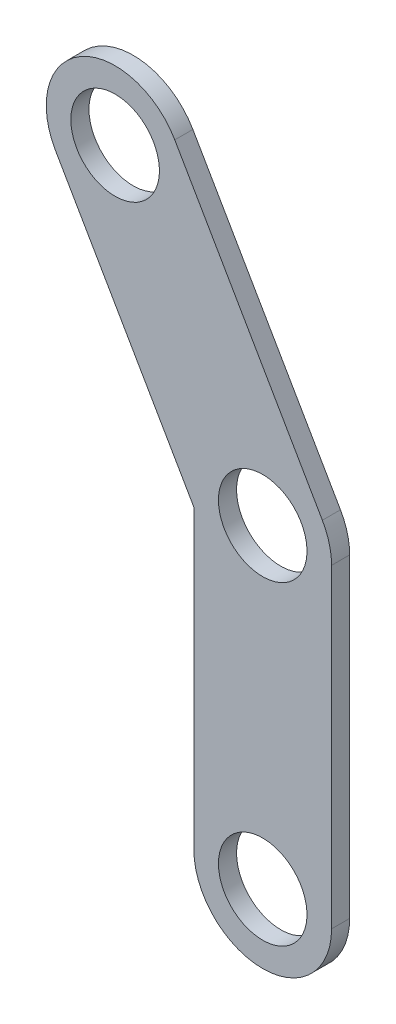
ISO-10303-21;
HEADER;
FILE_DESCRIPTION(('STEP AP214'),'2;1');
FILE_NAME('part.step','',(''),(''),'','','');
FILE_SCHEMA(('AUTOMOTIVE_DESIGN { 1 0 10303 214 1 1 1 1 }'));
ENDSEC;
DATA;
#1=APPLICATION_CONTEXT('core data for automotive mechanical design processes');
#2=APPLICATION_PROTOCOL_DEFINITION('international standard','automotive_design',2000,#1);
#3=PRODUCT_CONTEXT('',#1,'mechanical');
#4=PRODUCT('Part','Part','',(#3));
#5=PRODUCT_RELATED_PRODUCT_CATEGORY('part','',(#4));
#6=PRODUCT_DEFINITION_FORMATION('','',#4);
#7=PRODUCT_DEFINITION_CONTEXT('part definition',#1,'design');
#8=PRODUCT_DEFINITION('design','',#6,#7);
#9=PRODUCT_DEFINITION_SHAPE('','',#8);
#10=(LENGTH_UNIT() NAMED_UNIT(*) SI_UNIT(.MILLI.,.METRE.));
#11=(NAMED_UNIT(*) PLANE_ANGLE_UNIT() SI_UNIT($,.RADIAN.));
#12=(NAMED_UNIT(*) SI_UNIT($,.STERADIAN.) SOLID_ANGLE_UNIT());
#13=UNCERTAINTY_MEASURE_WITH_UNIT(LENGTH_MEASURE(1.E-05),#10,'distance_accuracy_value','');
#14=(GEOMETRIC_REPRESENTATION_CONTEXT(3) GLOBAL_UNCERTAINTY_ASSIGNED_CONTEXT((#13)) GLOBAL_UNIT_ASSIGNED_CONTEXT((#10,
#11,#12)) REPRESENTATION_CONTEXT('',''));
#15=CARTESIAN_POINT('',(0.,0.,0.));
#16=DIRECTION('',(0.,0.,1.));
#17=DIRECTION('',(1.,0.,0.));
#18=AXIS2_PLACEMENT_3D('',#15,#16,#17);
#19=CARTESIAN_POINT('',(25.4623037863386,14.7006679451928,5.842));
#20=DIRECTION('',(0.866025403784995,0.499999999999036,0.));
#21=DIRECTION('',(-0.499999999999036,0.866025403784995,0.));
#22=AXIS2_PLACEMENT_3D('',#19,#20,#21);
#23=PLANE('',#22);
#24=DIRECTION('',(0.499999999999036,-0.866025403784995,0.));
#25=VECTOR('',#24,1.);
#26=CARTESIAN_POINT('',(25.4623037863386,14.7006679451928,0.));
#27=LINE('',#26,#25);
#28=CARTESIAN_POINT('',(-79.9411607588512,197.264823831716,0.));
#29=VERTEX_POINT('',#28);
#30=CARTESIAN_POINT('',(-32.316160758943,114.775904121195,0.));
#31=VERTEX_POINT('',#30);
#32=EDGE_CURVE('E138',#29,#31,#27,.T.);
#33=ORIENTED_EDGE('',*,*,#32,.F.);
#34=DIRECTION('',(0.,0.,-1.));
#35=VECTOR('',#34,1.);
#36=CARTESIAN_POINT('',(-79.9411607588512,197.264823831716,5.842));
#37=LINE('',#36,#35);
#38=CARTESIAN_POINT('',(-79.9411607588512,197.264823831716,5.842));
#39=VERTEX_POINT('',#38);
#40=EDGE_CURVE('E11',#39,#29,#37,.T.);
#41=ORIENTED_EDGE('',*,*,#40,.F.);
#42=DIRECTION('',(0.499999999999036,-0.866025403784995,0.));
#43=VECTOR('',#42,1.);
#44=CARTESIAN_POINT('',(25.4623037863386,14.7006679451928,5.842));
#45=LINE('',#44,#43);
#46=CARTESIAN_POINT('',(-32.316160758943,114.775904121195,5.842));
#47=VERTEX_POINT('',#46);
#48=EDGE_CURVE('E164',#39,#47,#45,.T.);
#49=ORIENTED_EDGE('',*,*,#48,.T.);
#50=DIRECTION('',(0.,0.,-1.));
#51=VECTOR('',#50,1.);
#52=CARTESIAN_POINT('',(-32.316160758943,114.775904121195,5.842));
#53=LINE('',#52,#51);
#54=EDGE_CURVE('E40',#47,#31,#53,.T.);
#55=ORIENTED_EDGE('',*,*,#54,.T.);
#56=EDGE_LOOP('',(#33,#41,#49,#55));
#57=FACE_BOUND('',#56,.T.);
#58=ADVANCED_FACE('F37',(#57),#23,.T.);
#59=CARTESIAN_POINT('',(-99.1885753579727,186.152323831737,5.842));
#60=DIRECTION('',(0.,0.,-1.));
#61=DIRECTION('',(-1.,0.,0.));
#62=AXIS2_PLACEMENT_3D('',#59,#60,#61);
#63=CYLINDRICAL_SURFACE('',#62,22.225);
#64=CARTESIAN_POINT('',(-99.1885753579727,186.152323831737,0.));
#65=DIRECTION('',(0.,0.,-1.));
#66=DIRECTION('',(-1.,0.,0.));
#67=AXIS2_PLACEMENT_3D('',#64,#65,#66);
#68=CIRCLE('',#67,22.225);
#69=CARTESIAN_POINT('',(-118.435989957081,175.039823831736,0.));
#70=VERTEX_POINT('',#69);
#71=EDGE_CURVE('E153',#70,#29,#68,.T.);
#72=ORIENTED_EDGE('',*,*,#71,.F.);
#73=DIRECTION('',(0.,0.,-1.));
#74=VECTOR('',#73,1.);
#75=CARTESIAN_POINT('',(-118.435989957081,175.039823831736,5.842));
#76=LINE('',#75,#74);
#77=CARTESIAN_POINT('',(-118.435989957081,175.039823831736,5.842));
#78=VERTEX_POINT('',#77);
#79=EDGE_CURVE('E46',#78,#70,#76,.T.);
#80=ORIENTED_EDGE('',*,*,#79,.F.);
#81=CARTESIAN_POINT('',(-99.1885753579727,186.152323831737,5.842));
#82=DIRECTION('',(0.,0.,-1.));
#83=DIRECTION('',(-1.,0.,0.));
#84=AXIS2_PLACEMENT_3D('',#81,#82,#83);
#85=CIRCLE('',#84,22.225);
#86=EDGE_CURVE('E111',#78,#39,#85,.T.);
#87=ORIENTED_EDGE('',*,*,#86,.T.);
#88=ORIENTED_EDGE('',*,*,#40,.T.);
#89=EDGE_LOOP('',(#72,#80,#87,#88));
#90=FACE_BOUND('',#89,.T.);
#91=ADVANCED_FACE('F176',(#90),#63,.T.);
#92=CARTESIAN_POINT('',(-13.0325254116829,-7.5243320546567,5.842));
#93=DIRECTION('',(0.866025403784412,0.500000000000046,0.));
#94=DIRECTION('',(-0.500000000000046,0.866025403784412,0.));
#95=AXIS2_PLACEMENT_3D('',#92,#93,#94);
#96=PLANE('',#95);
#97=DIRECTION('',(0.500000000000046,-0.866025403784412,0.));
#98=VECTOR('',#97,1.);
#99=CARTESIAN_POINT('',(-13.0325254116829,-7.5243320546567,0.));
#100=LINE('',#99,#98);
#101=CARTESIAN_POINT('',(-73.7885753580673,97.7082333196606,0.));
#102=VERTEX_POINT('',#101);
#103=EDGE_CURVE('E115',#70,#102,#100,.T.);
#104=ORIENTED_EDGE('',*,*,#103,.T.);
#105=DIRECTION('',(0.,0.,-1.));
#106=VECTOR('',#105,1.);
#107=CARTESIAN_POINT('',(-73.7885753580673,97.7082333196606,5.842));
#108=LINE('',#107,#106);
#109=CARTESIAN_POINT('',(-73.7885753580673,97.7082333196606,5.842));
#110=VERTEX_POINT('',#109);
#111=EDGE_CURVE('E113',#110,#102,#108,.T.);
#112=ORIENTED_EDGE('',*,*,#111,.F.);
#113=DIRECTION('',(0.500000000000046,-0.866025403784412,0.));
#114=VECTOR('',#113,1.);
#115=CARTESIAN_POINT('',(-13.0325254116829,-7.5243320546567,5.842));
#116=LINE('',#115,#114);
#117=EDGE_CURVE('E103',#78,#110,#116,.T.);
#118=ORIENTED_EDGE('',*,*,#117,.F.);
#119=ORIENTED_EDGE('',*,*,#79,.T.);
#120=EDGE_LOOP('',(#104,#112,#118,#119));
#121=FACE_BOUND('',#120,.T.);
#122=ADVANCED_FACE('F114',(#121),#96,.F.);
#123=CARTESIAN_POINT('',(-73.7885753580673,0.,5.842));
#124=DIRECTION('',(-1.,0.,0.));
#125=DIRECTION('',(0.,0.,1.));
#126=AXIS2_PLACEMENT_3D('',#123,#124,#125);
#127=PLANE('',#126);
#128=DIRECTION('',(0.,1.,0.));
#129=VECTOR('',#128,1.);
#130=CARTESIAN_POINT('',(-73.7885753580673,0.,0.));
#131=LINE('',#130,#129);
#132=CARTESIAN_POINT('',(-73.7885753580673,2.06340412124388,0.));
#133=VERTEX_POINT('',#132);
#134=EDGE_CURVE('E150',#133,#102,#131,.T.);
#135=ORIENTED_EDGE('',*,*,#134,.F.);
#136=DIRECTION('',(0.,0.,-1.));
#137=VECTOR('',#136,1.);
#138=CARTESIAN_POINT('',(-73.7885753580673,2.06340412124388,5.842));
#139=LINE('',#138,#137);
#140=CARTESIAN_POINT('',(-73.7885753580673,2.06340412124388,5.842));
#141=VERTEX_POINT('',#140);
#142=EDGE_CURVE('E119',#141,#133,#139,.T.);
#143=ORIENTED_EDGE('',*,*,#142,.F.);
#144=DIRECTION('',(0.,1.,0.));
#145=VECTOR('',#144,1.);
#146=CARTESIAN_POINT('',(-73.7885753580673,0.,5.842));
#147=LINE('',#146,#145);
#148=EDGE_CURVE('E109',#141,#110,#147,.T.);
#149=ORIENTED_EDGE('',*,*,#148,.T.);
#150=ORIENTED_EDGE('',*,*,#111,.T.);
#151=EDGE_LOOP('',(#135,#143,#149,#150));
#152=FACE_BOUND('',#151,.T.);
#153=ADVANCED_FACE('F121',(#152),#127,.T.);
#154=CARTESIAN_POINT('',(-51.5635753580696,2.06340412124388,5.842));
#155=DIRECTION('',(0.,0.,-1.));
#156=DIRECTION('',(-1.,0.,0.));
#157=AXIS2_PLACEMENT_3D('',#154,#155,#156);
#158=CYLINDRICAL_SURFACE('',#157,22.2249999999977);
#159=CARTESIAN_POINT('',(-51.5635753580696,2.06340412124388,0.));
#160=DIRECTION('',(0.,0.,-1.));
#161=DIRECTION('',(-1.,0.,0.));
#162=AXIS2_PLACEMENT_3D('',#159,#160,#161);
#163=CIRCLE('',#162,22.2249999999977);
#164=CARTESIAN_POINT('',(-29.3385753580719,2.06340412124388,0.));
#165=VERTEX_POINT('',#164);
#166=EDGE_CURVE('E147',#165,#133,#163,.T.);
#167=ORIENTED_EDGE('',*,*,#166,.F.);
#168=DIRECTION('',(0.,0.,-1.));
#169=VECTOR('',#168,1.);
#170=CARTESIAN_POINT('',(-29.3385753580719,2.06340412124388,5.842));
#171=LINE('',#170,#169);
#172=CARTESIAN_POINT('',(-29.3385753580719,2.06340412124388,5.842));
#173=VERTEX_POINT('',#172);
#174=EDGE_CURVE('E168',#173,#165,#171,.T.);
#175=ORIENTED_EDGE('',*,*,#174,.F.);
#176=CARTESIAN_POINT('',(-51.5635753580696,2.06340412124388,5.842));
#177=DIRECTION('',(0.,0.,-1.));
#178=DIRECTION('',(-1.,0.,0.));
#179=AXIS2_PLACEMENT_3D('',#176,#177,#178);
#180=CIRCLE('',#179,22.2249999999977);
#181=EDGE_CURVE('E122',#173,#141,#180,.T.);
#182=ORIENTED_EDGE('',*,*,#181,.T.);
#183=ORIENTED_EDGE('',*,*,#142,.T.);
#184=EDGE_LOOP('',(#167,#175,#182,#183));
#185=FACE_BOUND('',#184,.T.);
#186=ADVANCED_FACE('F190',(#185),#158,.T.);
#187=CARTESIAN_POINT('',(-29.3385753580719,0.,5.842));
#188=DIRECTION('',(-1.,0.,0.));
#189=DIRECTION('',(0.,-1.,0.));
#190=AXIS2_PLACEMENT_3D('',#187,#188,#189);
#191=PLANE('',#190);
#192=DIRECTION('',(0.,1.,0.));
#193=VECTOR('',#192,1.);
#194=CARTESIAN_POINT('',(-29.3385753580719,0.,0.));
#195=LINE('',#194,#193);
#196=CARTESIAN_POINT('',(-29.3385753580719,103.663404121244,0.));
#197=VERTEX_POINT('',#196);
#198=EDGE_CURVE('E144',#165,#197,#195,.T.);
#199=ORIENTED_EDGE('',*,*,#198,.T.);
#200=DIRECTION('',(0.,0.,-1.));
#201=VECTOR('',#200,1.);
#202=CARTESIAN_POINT('',(-29.3385753580719,103.663404121244,5.842));
#203=LINE('',#202,#201);
#204=CARTESIAN_POINT('',(-29.3385753580719,103.663404121244,5.842));
#205=VERTEX_POINT('',#204);
#206=EDGE_CURVE('E169',#205,#197,#203,.T.);
#207=ORIENTED_EDGE('',*,*,#206,.F.);
#208=DIRECTION('',(0.,1.,0.));
#209=VECTOR('',#208,1.);
#210=CARTESIAN_POINT('',(-29.3385753580719,0.,5.842));
#211=LINE('',#210,#209);
#212=EDGE_CURVE('E124',#173,#205,#211,.T.);
#213=ORIENTED_EDGE('',*,*,#212,.F.);
#214=ORIENTED_EDGE('',*,*,#174,.T.);
#215=EDGE_LOOP('',(#199,#207,#213,#214));
#216=FACE_BOUND('',#215,.T.);
#217=ADVANCED_FACE('F193',(#216),#191,.F.);
#218=CARTESIAN_POINT('',(-51.5635753580164,103.663404121244,5.842));
#219=DIRECTION('',(0.,0.,-1.));
#220=DIRECTION('',(-1.,0.,0.));
#221=AXIS2_PLACEMENT_3D('',#218,#219,#220);
#222=CYLINDRICAL_SURFACE('',#221,14.2874999999445);
#223=CARTESIAN_POINT('',(-51.5635753580164,103.663404121244,5.842));
#224=DIRECTION('',(0.,0.,-1.));
#225=DIRECTION('',(-1.,0.,0.));
#226=AXIS2_PLACEMENT_3D('',#223,#224,#225);
#227=CIRCLE('',#226,14.2874999999445);
#228=CARTESIAN_POINT('',(-65.851075357961,103.663404121244,5.842));
#229=VERTEX_POINT('',#228);
#230=EDGE_CURVE('E132',#229,#229,#227,.F.);
#231=ORIENTED_EDGE('',*,*,#230,.T.);
#232=EDGE_LOOP('',(#231));
#233=FACE_BOUND('',#232,.T.);
#234=CARTESIAN_POINT('',(-51.5635753580164,103.663404121244,0.));
#235=DIRECTION('',(0.,0.,-1.));
#236=DIRECTION('',(-1.,0.,0.));
#237=AXIS2_PLACEMENT_3D('',#234,#235,#236);
#238=CIRCLE('',#237,14.2874999999445);
#239=CARTESIAN_POINT('',(-65.851075357961,103.663404121244,0.));
#240=VERTEX_POINT('',#239);
#241=EDGE_CURVE('E159',#240,#240,#238,.F.);
#242=ORIENTED_EDGE('',*,*,#241,.F.);
#243=EDGE_LOOP('',(#242));
#244=FACE_BOUND('',#243,.T.);
#245=ADVANCED_FACE('F196',(#233,#244),#222,.F.);
#246=CARTESIAN_POINT('',(-51.5635753580696,2.06340412124388,5.842));
#247=DIRECTION('',(0.,0.,-1.));
#248=DIRECTION('',(-1.,0.,0.));
#249=AXIS2_PLACEMENT_3D('',#246,#247,#248);
#250=CYLINDRICAL_SURFACE('',#249,14.2874999999977);
#251=CARTESIAN_POINT('',(-51.5635753580696,2.06340412124388,5.842));
#252=DIRECTION('',(0.,0.,-1.));
#253=DIRECTION('',(-1.,0.,0.));
#254=AXIS2_PLACEMENT_3D('',#251,#252,#253);
#255=CIRCLE('',#254,14.2874999999977);
#256=CARTESIAN_POINT('',(-65.8510753580673,2.06340412124388,5.842));
#257=VERTEX_POINT('',#256);
#258=EDGE_CURVE('E129',#257,#257,#255,.F.);
#259=ORIENTED_EDGE('',*,*,#258,.T.);
#260=EDGE_LOOP('',(#259));
#261=FACE_BOUND('',#260,.T.);
#262=CARTESIAN_POINT('',(-51.5635753580696,2.06340412124388,0.));
#263=DIRECTION('',(0.,0.,-1.));
#264=DIRECTION('',(-1.,0.,0.));
#265=AXIS2_PLACEMENT_3D('',#262,#263,#264);
#266=CIRCLE('',#265,14.2874999999977);
#267=CARTESIAN_POINT('',(-65.8510753580673,2.06340412124388,0.));
#268=VERTEX_POINT('',#267);
#269=EDGE_CURVE('E156',#268,#268,#266,.F.);
#270=ORIENTED_EDGE('',*,*,#269,.F.);
#271=EDGE_LOOP('',(#270));
#272=FACE_BOUND('',#271,.T.);
#273=ADVANCED_FACE('F185',(#261,#272),#250,.F.);
#274=CARTESIAN_POINT('',(-51.5635753580164,103.663404121244,5.842));
#275=DIRECTION('',(0.,0.,-1.));
#276=DIRECTION('',(-1.,0.,0.));
#277=AXIS2_PLACEMENT_3D('',#274,#275,#276);
#278=CYLINDRICAL_SURFACE('',#277,22.2249999999445);
#279=CARTESIAN_POINT('',(-51.5635753580164,103.663404121244,0.));
#280=DIRECTION('',(0.,0.,-1.));
#281=DIRECTION('',(-1.,0.,0.));
#282=AXIS2_PLACEMENT_3D('',#279,#280,#281);
#283=CIRCLE('',#282,22.2249999999445);
#284=EDGE_CURVE('E141',#31,#197,#283,.T.);
#285=ORIENTED_EDGE('',*,*,#284,.F.);
#286=ORIENTED_EDGE('',*,*,#54,.F.);
#287=CARTESIAN_POINT('',(-51.5635753580164,103.663404121244,5.842));
#288=DIRECTION('',(0.,0.,-1.));
#289=DIRECTION('',(-1.,0.,0.));
#290=AXIS2_PLACEMENT_3D('',#287,#288,#289);
#291=CIRCLE('',#290,22.2249999999445);
#292=EDGE_CURVE('E320',#47,#205,#291,.T.);
#293=ORIENTED_EDGE('',*,*,#292,.T.);
#294=ORIENTED_EDGE('',*,*,#206,.T.);
#295=EDGE_LOOP('',(#285,#286,#293,#294));
#296=FACE_BOUND('',#295,.T.);
#297=ADVANCED_FACE('F171',(#296),#278,.T.);
#298=CARTESIAN_POINT('',(-99.1885753579727,186.152323831737,5.842));
#299=DIRECTION('',(0.,0.,-1.));
#300=DIRECTION('',(-1.,0.,0.));
#301=AXIS2_PLACEMENT_3D('',#298,#299,#300);
#302=CYLINDRICAL_SURFACE('',#301,14.2874999999771);
#303=CARTESIAN_POINT('',(-99.1885753579727,186.152323831737,5.842));
#304=DIRECTION('',(0.,0.,-1.));
#305=DIRECTION('',(-1.,0.,0.));
#306=AXIS2_PLACEMENT_3D('',#303,#304,#305);
#307=CIRCLE('',#306,14.2874999999771);
#308=CARTESIAN_POINT('',(-113.47607535795,186.152323831737,5.842));
#309=VERTEX_POINT('',#308);
#310=EDGE_CURVE('E135',#309,#309,#307,.F.);
#311=ORIENTED_EDGE('',*,*,#310,.T.);
#312=EDGE_LOOP('',(#311));
#313=FACE_BOUND('',#312,.T.);
#314=CARTESIAN_POINT('',(-99.1885753579727,186.152323831737,0.));
#315=DIRECTION('',(0.,0.,-1.));
#316=DIRECTION('',(-1.,0.,0.));
#317=AXIS2_PLACEMENT_3D('',#314,#315,#316);
#318=CIRCLE('',#317,14.2874999999771);
#319=CARTESIAN_POINT('',(-113.47607535795,186.152323831737,0.));
#320=VERTEX_POINT('',#319);
#321=EDGE_CURVE('E162',#320,#320,#318,.F.);
#322=ORIENTED_EDGE('',*,*,#321,.F.);
#323=EDGE_LOOP('',(#322));
#324=FACE_BOUND('',#323,.T.);
#325=ADVANCED_FACE('F199',(#313,#324),#302,.F.);
#326=CARTESIAN_POINT('',(0.,0.,5.842));
#327=DIRECTION('',(0.,0.,-1.));
#328=DIRECTION('',(-1.,0.,0.));
#329=AXIS2_PLACEMENT_3D('',#326,#327,#328);
#330=PLANE('',#329);
#331=ORIENTED_EDGE('',*,*,#48,.F.);
#332=ORIENTED_EDGE('',*,*,#86,.F.);
#333=ORIENTED_EDGE('',*,*,#117,.T.);
#334=ORIENTED_EDGE('',*,*,#148,.F.);
#335=ORIENTED_EDGE('',*,*,#181,.F.);
#336=ORIENTED_EDGE('',*,*,#212,.T.);
#337=ORIENTED_EDGE('',*,*,#292,.F.);
#338=EDGE_LOOP('',(#331,#332,#333,#334,#335,#336,#337));
#339=FACE_BOUND('',#338,.T.);
#340=ORIENTED_EDGE('',*,*,#258,.F.);
#341=EDGE_LOOP('',(#340));
#342=FACE_BOUND('',#341,.T.);
#343=ORIENTED_EDGE('',*,*,#230,.F.);
#344=EDGE_LOOP('',(#343));
#345=FACE_BOUND('',#344,.T.);
#346=ORIENTED_EDGE('',*,*,#310,.F.);
#347=EDGE_LOOP('',(#346));
#348=FACE_BOUND('',#347,.T.);
#349=ADVANCED_FACE('F105',(#339,#342,#345,#348),#330,.F.);
#350=CARTESIAN_POINT('',(0.,0.,0.));
#351=DIRECTION('',(0.,0.,-1.));
#352=DIRECTION('',(-1.,0.,0.));
#353=AXIS2_PLACEMENT_3D('',#350,#351,#352);
#354=PLANE('',#353);
#355=ORIENTED_EDGE('',*,*,#32,.T.);
#356=ORIENTED_EDGE('',*,*,#284,.T.);
#357=ORIENTED_EDGE('',*,*,#198,.F.);
#358=ORIENTED_EDGE('',*,*,#166,.T.);
#359=ORIENTED_EDGE('',*,*,#134,.T.);
#360=ORIENTED_EDGE('',*,*,#103,.F.);
#361=ORIENTED_EDGE('',*,*,#71,.T.);
#362=EDGE_LOOP('',(#355,#356,#357,#358,#359,#360,#361));
#363=FACE_BOUND('',#362,.T.);
#364=ORIENTED_EDGE('',*,*,#269,.T.);
#365=EDGE_LOOP('',(#364));
#366=FACE_BOUND('',#365,.T.);
#367=ORIENTED_EDGE('',*,*,#241,.T.);
#368=EDGE_LOOP('',(#367));
#369=FACE_BOUND('',#368,.T.);
#370=ORIENTED_EDGE('',*,*,#321,.T.);
#371=EDGE_LOOP('',(#370));
#372=FACE_BOUND('',#371,.T.);
#373=ADVANCED_FACE('F174',(#363,#366,#369,#372),#354,.T.);
#374=CLOSED_SHELL('',(#58,#91,#122,#153,#186,#217,#245,#273,#297,#325,#349,#373));
#375=MANIFOLD_SOLID_BREP('B2',#374);
#376=ADVANCED_BREP_SHAPE_REPRESENTATION('',(#18,#375),#14);
#377=SHAPE_DEFINITION_REPRESENTATION(#9,#376);
ENDSEC;
END-ISO-10303-21;
